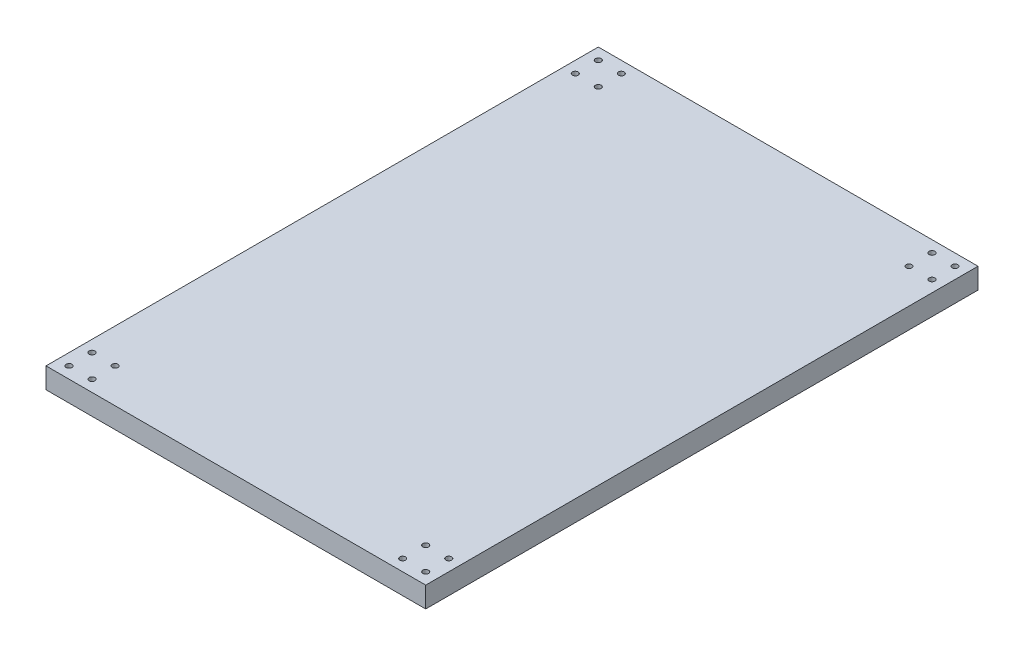
ISO-10303-21;
HEADER;
FILE_DESCRIPTION(('STEP AP214'),'2;1');
FILE_NAME('part.step','',(''),(''),'','','');
FILE_SCHEMA(('AUTOMOTIVE_DESIGN { 1 0 10303 214 1 1 1 1 }'));
ENDSEC;
DATA;
#1=APPLICATION_CONTEXT('core data for automotive mechanical design processes');
#2=APPLICATION_PROTOCOL_DEFINITION('international standard','automotive_design',2000,#1);
#3=PRODUCT_CONTEXT('',#1,'mechanical');
#4=PRODUCT('Part','Part','',(#3));
#5=PRODUCT_RELATED_PRODUCT_CATEGORY('part','',(#4));
#6=PRODUCT_DEFINITION_FORMATION('','',#4);
#7=PRODUCT_DEFINITION_CONTEXT('part definition',#1,'design');
#8=PRODUCT_DEFINITION('design','',#6,#7);
#9=PRODUCT_DEFINITION_SHAPE('','',#8);
#10=(LENGTH_UNIT() NAMED_UNIT(*) SI_UNIT(.MILLI.,.METRE.));
#11=(NAMED_UNIT(*) PLANE_ANGLE_UNIT() SI_UNIT($,.RADIAN.));
#12=(NAMED_UNIT(*) SI_UNIT($,.STERADIAN.) SOLID_ANGLE_UNIT());
#13=UNCERTAINTY_MEASURE_WITH_UNIT(LENGTH_MEASURE(1.E-05),#10,'distance_accuracy_value','');
#14=(GEOMETRIC_REPRESENTATION_CONTEXT(3) GLOBAL_UNCERTAINTY_ASSIGNED_CONTEXT((#13)) GLOBAL_UNIT_ASSIGNED_CONTEXT((#10,
#11,#12)) REPRESENTATION_CONTEXT('',''));
#15=CARTESIAN_POINT('',(0.,0.,0.));
#16=DIRECTION('',(0.,0.,1.));
#17=DIRECTION('',(1.,0.,0.));
#18=AXIS2_PLACEMENT_3D('',#15,#16,#17);
#19=CARTESIAN_POINT('',(0.,18.,0.));
#20=DIRECTION('',(0.,-1.,0.));
#21=DIRECTION('',(0.,0.,-1.));
#22=AXIS2_PLACEMENT_3D('',#19,#20,#21);
#23=PLANE('',#22);
#24=DIRECTION('',(0.,0.,1.));
#25=VECTOR('',#24,1.);
#26=CARTESIAN_POINT('',(0.,18.,0.));
#27=LINE('',#26,#25);
#28=CARTESIAN_POINT('',(0.,18.,-480.));
#29=VERTEX_POINT('',#28);
#30=CARTESIAN_POINT('',(0.,18.,0.));
#31=VERTEX_POINT('',#30);
#32=EDGE_CURVE('E93',#29,#31,#27,.T.);
#33=ORIENTED_EDGE('',*,*,#32,.T.);
#34=DIRECTION('',(1.,0.,0.));
#35=VECTOR('',#34,1.);
#36=CARTESIAN_POINT('',(0.,18.,0.));
#37=LINE('',#36,#35);
#38=CARTESIAN_POINT('',(330.,18.,0.));
#39=VERTEX_POINT('',#38);
#40=EDGE_CURVE('E88',#31,#39,#37,.T.);
#41=ORIENTED_EDGE('',*,*,#40,.T.);
#42=DIRECTION('',(0.,0.,-1.));
#43=VECTOR('',#42,1.);
#44=CARTESIAN_POINT('',(330.,18.,0.));
#45=LINE('',#44,#43);
#46=CARTESIAN_POINT('',(330.,18.,-480.));
#47=VERTEX_POINT('',#46);
#48=EDGE_CURVE('E91',#39,#47,#45,.T.);
#49=ORIENTED_EDGE('',*,*,#48,.T.);
#50=DIRECTION('',(-1.,0.,0.));
#51=VECTOR('',#50,1.);
#52=CARTESIAN_POINT('',(0.,18.,-480.));
#53=LINE('',#52,#51);
#54=EDGE_CURVE('E58',#47,#29,#53,.T.);
#55=ORIENTED_EDGE('',*,*,#54,.T.);
#56=EDGE_LOOP('',(#33,#41,#49,#55));
#57=FACE_BOUND('',#56,.T.);
#58=CARTESIAN_POINT('',(10.,18.,-10.));
#59=DIRECTION('',(0.,1.,0.));
#60=DIRECTION('',(0.,0.,1.));
#61=AXIS2_PLACEMENT_3D('',#58,#59,#60);
#62=CIRCLE('',#61,2.5);
#63=CARTESIAN_POINT('',(10.,18.,-7.5));
#64=VERTEX_POINT('',#63);
#65=EDGE_CURVE('E108',#64,#64,#62,.T.);
#66=ORIENTED_EDGE('',*,*,#65,.F.);
#67=EDGE_LOOP('',(#66));
#68=FACE_BOUND('',#67,.T.);
#69=CARTESIAN_POINT('',(30.,18.,-9.99999999999999));
#70=DIRECTION('',(0.,1.,0.));
#71=DIRECTION('',(0.,0.,1.));
#72=AXIS2_PLACEMENT_3D('',#69,#70,#71);
#73=CIRCLE('',#72,2.49999999999999);
#74=CARTESIAN_POINT('',(30.,18.,-7.5));
#75=VERTEX_POINT('',#74);
#76=EDGE_CURVE('E123',#75,#75,#73,.T.);
#77=ORIENTED_EDGE('',*,*,#76,.F.);
#78=EDGE_LOOP('',(#77));
#79=FACE_BOUND('',#78,.T.);
#80=CARTESIAN_POINT('',(10.,18.,-30.));
#81=DIRECTION('',(0.,1.,0.));
#82=DIRECTION('',(0.,0.,1.));
#83=AXIS2_PLACEMENT_3D('',#80,#81,#82);
#84=CIRCLE('',#83,2.5);
#85=CARTESIAN_POINT('',(10.,18.,-27.5));
#86=VERTEX_POINT('',#85);
#87=EDGE_CURVE('E129',#86,#86,#84,.T.);
#88=ORIENTED_EDGE('',*,*,#87,.F.);
#89=EDGE_LOOP('',(#88));
#90=FACE_BOUND('',#89,.T.);
#91=CARTESIAN_POINT('',(30.,18.,-30.));
#92=DIRECTION('',(0.,1.,0.));
#93=DIRECTION('',(0.,0.,1.));
#94=AXIS2_PLACEMENT_3D('',#91,#92,#93);
#95=CIRCLE('',#94,2.49999999999999);
#96=CARTESIAN_POINT('',(30.,18.,-27.5));
#97=VERTEX_POINT('',#96);
#98=EDGE_CURVE('E135',#97,#97,#95,.T.);
#99=ORIENTED_EDGE('',*,*,#98,.F.);
#100=EDGE_LOOP('',(#99));
#101=FACE_BOUND('',#100,.T.);
#102=CARTESIAN_POINT('',(320.,18.,-30.));
#103=DIRECTION('',(0.,1.,0.));
#104=DIRECTION('',(0.,0.,-1.));
#105=AXIS2_PLACEMENT_3D('',#102,#103,#104);
#106=CIRCLE('',#105,2.50000000000002);
#107=CARTESIAN_POINT('',(320.,18.,-32.5));
#108=VERTEX_POINT('',#107);
#109=EDGE_CURVE('E141',#108,#108,#106,.T.);
#110=ORIENTED_EDGE('',*,*,#109,.F.);
#111=EDGE_LOOP('',(#110));
#112=FACE_BOUND('',#111,.T.);
#113=CARTESIAN_POINT('',(320.,18.,-10.));
#114=DIRECTION('',(0.,1.,0.));
#115=DIRECTION('',(0.,0.,-1.));
#116=AXIS2_PLACEMENT_3D('',#113,#114,#115);
#117=CIRCLE('',#116,2.50000000000002);
#118=CARTESIAN_POINT('',(320.,18.,-12.5));
#119=VERTEX_POINT('',#118);
#120=EDGE_CURVE('E147',#119,#119,#117,.T.);
#121=ORIENTED_EDGE('',*,*,#120,.F.);
#122=EDGE_LOOP('',(#121));
#123=FACE_BOUND('',#122,.T.);
#124=CARTESIAN_POINT('',(300.,18.,-9.99999999999999));
#125=DIRECTION('',(0.,1.,0.));
#126=DIRECTION('',(0.,0.,-1.));
#127=AXIS2_PLACEMENT_3D('',#124,#125,#126);
#128=CIRCLE('',#127,2.50000000000002);
#129=CARTESIAN_POINT('',(300.,18.,-12.5));
#130=VERTEX_POINT('',#129);
#131=EDGE_CURVE('E153',#130,#130,#128,.T.);
#132=ORIENTED_EDGE('',*,*,#131,.F.);
#133=EDGE_LOOP('',(#132));
#134=FACE_BOUND('',#133,.T.);
#135=CARTESIAN_POINT('',(300.,18.,-30.));
#136=DIRECTION('',(0.,1.,0.));
#137=DIRECTION('',(0.,0.,-1.));
#138=AXIS2_PLACEMENT_3D('',#135,#136,#137);
#139=CIRCLE('',#138,2.50000000000002);
#140=CARTESIAN_POINT('',(300.,18.,-32.5));
#141=VERTEX_POINT('',#140);
#142=EDGE_CURVE('E159',#141,#141,#139,.T.);
#143=ORIENTED_EDGE('',*,*,#142,.F.);
#144=EDGE_LOOP('',(#143));
#145=FACE_BOUND('',#144,.T.);
#146=CARTESIAN_POINT('',(300.,18.,-470.));
#147=DIRECTION('',(0.,1.,0.));
#148=DIRECTION('',(0.,0.,1.));
#149=AXIS2_PLACEMENT_3D('',#146,#147,#148);
#150=CIRCLE('',#149,2.50000000000001);
#151=CARTESIAN_POINT('',(300.,18.,-467.5));
#152=VERTEX_POINT('',#151);
#153=EDGE_CURVE('E165',#152,#152,#150,.T.);
#154=ORIENTED_EDGE('',*,*,#153,.F.);
#155=EDGE_LOOP('',(#154));
#156=FACE_BOUND('',#155,.T.);
#157=CARTESIAN_POINT('',(320.,18.,-470.));
#158=DIRECTION('',(0.,1.,0.));
#159=DIRECTION('',(0.,0.,1.));
#160=AXIS2_PLACEMENT_3D('',#157,#158,#159);
#161=CIRCLE('',#160,2.50000000000002);
#162=CARTESIAN_POINT('',(320.,18.,-467.5));
#163=VERTEX_POINT('',#162);
#164=EDGE_CURVE('E171',#163,#163,#161,.T.);
#165=ORIENTED_EDGE('',*,*,#164,.F.);
#166=EDGE_LOOP('',(#165));
#167=FACE_BOUND('',#166,.T.);
#168=CARTESIAN_POINT('',(320.,18.,-450.));
#169=DIRECTION('',(0.,1.,0.));
#170=DIRECTION('',(0.,0.,1.));
#171=AXIS2_PLACEMENT_3D('',#168,#169,#170);
#172=CIRCLE('',#171,2.50000000000002);
#173=CARTESIAN_POINT('',(320.,18.,-447.5));
#174=VERTEX_POINT('',#173);
#175=EDGE_CURVE('E177',#174,#174,#172,.T.);
#176=ORIENTED_EDGE('',*,*,#175,.F.);
#177=EDGE_LOOP('',(#176));
#178=FACE_BOUND('',#177,.T.);
#179=CARTESIAN_POINT('',(300.,18.,-450.));
#180=DIRECTION('',(0.,1.,0.));
#181=DIRECTION('',(0.,0.,1.));
#182=AXIS2_PLACEMENT_3D('',#179,#180,#181);
#183=CIRCLE('',#182,2.50000000000002);
#184=CARTESIAN_POINT('',(300.,18.,-447.5));
#185=VERTEX_POINT('',#184);
#186=EDGE_CURVE('E183',#185,#185,#183,.T.);
#187=ORIENTED_EDGE('',*,*,#186,.F.);
#188=EDGE_LOOP('',(#187));
#189=FACE_BOUND('',#188,.T.);
#190=CARTESIAN_POINT('',(30.,18.,-470.));
#191=DIRECTION('',(0.,1.,0.));
#192=DIRECTION('',(0.,0.,-1.));
#193=AXIS2_PLACEMENT_3D('',#190,#191,#192);
#194=CIRCLE('',#193,2.49999999999998);
#195=CARTESIAN_POINT('',(30.,18.,-472.5));
#196=VERTEX_POINT('',#195);
#197=EDGE_CURVE('E189',#196,#196,#194,.T.);
#198=ORIENTED_EDGE('',*,*,#197,.F.);
#199=EDGE_LOOP('',(#198));
#200=FACE_BOUND('',#199,.T.);
#201=CARTESIAN_POINT('',(10.,18.,-470.));
#202=DIRECTION('',(0.,1.,0.));
#203=DIRECTION('',(0.,0.,-1.));
#204=AXIS2_PLACEMENT_3D('',#201,#202,#203);
#205=CIRCLE('',#204,2.5);
#206=CARTESIAN_POINT('',(10.,18.,-472.5));
#207=VERTEX_POINT('',#206);
#208=EDGE_CURVE('E195',#207,#207,#205,.T.);
#209=ORIENTED_EDGE('',*,*,#208,.F.);
#210=EDGE_LOOP('',(#209));
#211=FACE_BOUND('',#210,.T.);
#212=CARTESIAN_POINT('',(10.,18.,-450.));
#213=DIRECTION('',(0.,1.,0.));
#214=DIRECTION('',(0.,0.,-1.));
#215=AXIS2_PLACEMENT_3D('',#212,#213,#214);
#216=CIRCLE('',#215,2.5);
#217=CARTESIAN_POINT('',(10.,18.,-452.5));
#218=VERTEX_POINT('',#217);
#219=EDGE_CURVE('E201',#218,#218,#216,.T.);
#220=ORIENTED_EDGE('',*,*,#219,.F.);
#221=EDGE_LOOP('',(#220));
#222=FACE_BOUND('',#221,.T.);
#223=CARTESIAN_POINT('',(30.,18.,-450.));
#224=DIRECTION('',(0.,1.,0.));
#225=DIRECTION('',(0.,0.,-1.));
#226=AXIS2_PLACEMENT_3D('',#223,#224,#225);
#227=CIRCLE('',#226,2.5);
#228=CARTESIAN_POINT('',(30.,18.,-452.5));
#229=VERTEX_POINT('',#228);
#230=EDGE_CURVE('E207',#229,#229,#227,.T.);
#231=ORIENTED_EDGE('',*,*,#230,.F.);
#232=EDGE_LOOP('',(#231));
#233=FACE_BOUND('',#232,.T.);
#234=ADVANCED_FACE('F41',(#57,#68,#79,#90,#101,#112,#123,#134,#145,#156,#167,#178,#189,#200,
#211,#222,#233),#23,.F.);
#235=CARTESIAN_POINT('',(0.,0.,0.));
#236=DIRECTION('',(0.,-1.,0.));
#237=DIRECTION('',(0.,0.,-1.));
#238=AXIS2_PLACEMENT_3D('',#235,#236,#237);
#239=PLANE('',#238);
#240=CARTESIAN_POINT('',(10.,0.,-450.));
#241=DIRECTION('',(0.,1.,0.));
#242=DIRECTION('',(0.,0.,-1.));
#243=AXIS2_PLACEMENT_3D('',#240,#241,#242);
#244=CIRCLE('',#243,2.5);
#245=CARTESIAN_POINT('',(10.,0.,-452.5));
#246=VERTEX_POINT('',#245);
#247=EDGE_CURVE('E204',#246,#246,#244,.T.);
#248=ORIENTED_EDGE('',*,*,#247,.T.);
#249=EDGE_LOOP('',(#248));
#250=FACE_BOUND('',#249,.T.);
#251=CARTESIAN_POINT('',(30.,0.,-470.));
#252=DIRECTION('',(0.,1.,0.));
#253=DIRECTION('',(0.,0.,-1.));
#254=AXIS2_PLACEMENT_3D('',#251,#252,#253);
#255=CIRCLE('',#254,2.49999999999998);
#256=CARTESIAN_POINT('',(30.,0.,-472.5));
#257=VERTEX_POINT('',#256);
#258=EDGE_CURVE('E192',#257,#257,#255,.T.);
#259=ORIENTED_EDGE('',*,*,#258,.T.);
#260=EDGE_LOOP('',(#259));
#261=FACE_BOUND('',#260,.T.);
#262=CARTESIAN_POINT('',(320.,0.,-450.));
#263=DIRECTION('',(0.,1.,0.));
#264=DIRECTION('',(0.,0.,1.));
#265=AXIS2_PLACEMENT_3D('',#262,#263,#264);
#266=CIRCLE('',#265,2.50000000000002);
#267=CARTESIAN_POINT('',(320.,0.,-447.5));
#268=VERTEX_POINT('',#267);
#269=EDGE_CURVE('E180',#268,#268,#266,.T.);
#270=ORIENTED_EDGE('',*,*,#269,.T.);
#271=EDGE_LOOP('',(#270));
#272=FACE_BOUND('',#271,.T.);
#273=CARTESIAN_POINT('',(300.,0.,-470.));
#274=DIRECTION('',(0.,1.,0.));
#275=DIRECTION('',(0.,0.,1.));
#276=AXIS2_PLACEMENT_3D('',#273,#274,#275);
#277=CIRCLE('',#276,2.50000000000001);
#278=CARTESIAN_POINT('',(300.,0.,-467.5));
#279=VERTEX_POINT('',#278);
#280=EDGE_CURVE('E168',#279,#279,#277,.T.);
#281=ORIENTED_EDGE('',*,*,#280,.T.);
#282=EDGE_LOOP('',(#281));
#283=FACE_BOUND('',#282,.T.);
#284=CARTESIAN_POINT('',(300.,0.,-9.99999999999999));
#285=DIRECTION('',(0.,1.,0.));
#286=DIRECTION('',(0.,0.,-1.));
#287=AXIS2_PLACEMENT_3D('',#284,#285,#286);
#288=CIRCLE('',#287,2.50000000000002);
#289=CARTESIAN_POINT('',(300.,0.,-12.5));
#290=VERTEX_POINT('',#289);
#291=EDGE_CURVE('E156',#290,#290,#288,.T.);
#292=ORIENTED_EDGE('',*,*,#291,.T.);
#293=EDGE_LOOP('',(#292));
#294=FACE_BOUND('',#293,.T.);
#295=CARTESIAN_POINT('',(320.,0.,-30.));
#296=DIRECTION('',(0.,1.,0.));
#297=DIRECTION('',(0.,0.,-1.));
#298=AXIS2_PLACEMENT_3D('',#295,#296,#297);
#299=CIRCLE('',#298,2.50000000000002);
#300=CARTESIAN_POINT('',(320.,0.,-32.5));
#301=VERTEX_POINT('',#300);
#302=EDGE_CURVE('E144',#301,#301,#299,.T.);
#303=ORIENTED_EDGE('',*,*,#302,.T.);
#304=EDGE_LOOP('',(#303));
#305=FACE_BOUND('',#304,.T.);
#306=CARTESIAN_POINT('',(10.,0.,-30.));
#307=DIRECTION('',(0.,1.,0.));
#308=DIRECTION('',(0.,0.,1.));
#309=AXIS2_PLACEMENT_3D('',#306,#307,#308);
#310=CIRCLE('',#309,2.5);
#311=CARTESIAN_POINT('',(10.,0.,-27.5));
#312=VERTEX_POINT('',#311);
#313=EDGE_CURVE('E132',#312,#312,#310,.T.);
#314=ORIENTED_EDGE('',*,*,#313,.T.);
#315=EDGE_LOOP('',(#314));
#316=FACE_BOUND('',#315,.T.);
#317=CARTESIAN_POINT('',(10.,0.,-10.));
#318=DIRECTION('',(0.,1.,0.));
#319=DIRECTION('',(0.,0.,1.));
#320=AXIS2_PLACEMENT_3D('',#317,#318,#319);
#321=CIRCLE('',#320,2.5);
#322=CARTESIAN_POINT('',(10.,0.,-7.5));
#323=VERTEX_POINT('',#322);
#324=EDGE_CURVE('E120',#323,#323,#321,.T.);
#325=ORIENTED_EDGE('',*,*,#324,.T.);
#326=EDGE_LOOP('',(#325));
#327=FACE_BOUND('',#326,.T.);
#328=DIRECTION('',(0.,0.,1.));
#329=VECTOR('',#328,1.);
#330=CARTESIAN_POINT('',(0.,0.,0.));
#331=LINE('',#330,#329);
#332=CARTESIAN_POINT('',(0.,0.,-480.));
#333=VERTEX_POINT('',#332);
#334=CARTESIAN_POINT('',(0.,0.,0.));
#335=VERTEX_POINT('',#334);
#336=EDGE_CURVE('E105',#333,#335,#331,.T.);
#337=ORIENTED_EDGE('',*,*,#336,.F.);
#338=DIRECTION('',(-1.,0.,0.));
#339=VECTOR('',#338,1.);
#340=CARTESIAN_POINT('',(0.,0.,-480.));
#341=LINE('',#340,#339);
#342=CARTESIAN_POINT('',(330.,0.,-480.));
#343=VERTEX_POINT('',#342);
#344=EDGE_CURVE('E81',#343,#333,#341,.T.);
#345=ORIENTED_EDGE('',*,*,#344,.F.);
#346=DIRECTION('',(0.,0.,-1.));
#347=VECTOR('',#346,1.);
#348=CARTESIAN_POINT('',(330.,0.,0.));
#349=LINE('',#348,#347);
#350=CARTESIAN_POINT('',(330.,0.,0.));
#351=VERTEX_POINT('',#350);
#352=EDGE_CURVE('E75',#351,#343,#349,.T.);
#353=ORIENTED_EDGE('',*,*,#352,.F.);
#354=DIRECTION('',(1.,0.,0.));
#355=VECTOR('',#354,1.);
#356=CARTESIAN_POINT('',(0.,0.,0.));
#357=LINE('',#356,#355);
#358=EDGE_CURVE('E97',#335,#351,#357,.T.);
#359=ORIENTED_EDGE('',*,*,#358,.F.);
#360=EDGE_LOOP('',(#337,#345,#353,#359));
#361=FACE_BOUND('',#360,.T.);
#362=CARTESIAN_POINT('',(30.,0.,-9.99999999999999));
#363=DIRECTION('',(0.,1.,0.));
#364=DIRECTION('',(0.,0.,1.));
#365=AXIS2_PLACEMENT_3D('',#362,#363,#364);
#366=CIRCLE('',#365,2.49999999999999);
#367=CARTESIAN_POINT('',(30.,0.,-7.5));
#368=VERTEX_POINT('',#367);
#369=EDGE_CURVE('E126',#368,#368,#366,.T.);
#370=ORIENTED_EDGE('',*,*,#369,.T.);
#371=EDGE_LOOP('',(#370));
#372=FACE_BOUND('',#371,.T.);
#373=CARTESIAN_POINT('',(30.,0.,-30.));
#374=DIRECTION('',(0.,1.,0.));
#375=DIRECTION('',(0.,0.,1.));
#376=AXIS2_PLACEMENT_3D('',#373,#374,#375);
#377=CIRCLE('',#376,2.49999999999999);
#378=CARTESIAN_POINT('',(30.,0.,-27.5));
#379=VERTEX_POINT('',#378);
#380=EDGE_CURVE('E138',#379,#379,#377,.T.);
#381=ORIENTED_EDGE('',*,*,#380,.T.);
#382=EDGE_LOOP('',(#381));
#383=FACE_BOUND('',#382,.T.);
#384=CARTESIAN_POINT('',(320.,0.,-10.));
#385=DIRECTION('',(0.,1.,0.));
#386=DIRECTION('',(0.,0.,-1.));
#387=AXIS2_PLACEMENT_3D('',#384,#385,#386);
#388=CIRCLE('',#387,2.50000000000002);
#389=CARTESIAN_POINT('',(320.,0.,-12.5));
#390=VERTEX_POINT('',#389);
#391=EDGE_CURVE('E150',#390,#390,#388,.T.);
#392=ORIENTED_EDGE('',*,*,#391,.T.);
#393=EDGE_LOOP('',(#392));
#394=FACE_BOUND('',#393,.T.);
#395=CARTESIAN_POINT('',(300.,0.,-30.));
#396=DIRECTION('',(0.,1.,0.));
#397=DIRECTION('',(0.,0.,-1.));
#398=AXIS2_PLACEMENT_3D('',#395,#396,#397);
#399=CIRCLE('',#398,2.50000000000002);
#400=CARTESIAN_POINT('',(300.,0.,-32.5));
#401=VERTEX_POINT('',#400);
#402=EDGE_CURVE('E162',#401,#401,#399,.T.);
#403=ORIENTED_EDGE('',*,*,#402,.T.);
#404=EDGE_LOOP('',(#403));
#405=FACE_BOUND('',#404,.T.);
#406=CARTESIAN_POINT('',(320.,0.,-470.));
#407=DIRECTION('',(0.,1.,0.));
#408=DIRECTION('',(0.,0.,1.));
#409=AXIS2_PLACEMENT_3D('',#406,#407,#408);
#410=CIRCLE('',#409,2.50000000000002);
#411=CARTESIAN_POINT('',(320.,0.,-467.5));
#412=VERTEX_POINT('',#411);
#413=EDGE_CURVE('E174',#412,#412,#410,.T.);
#414=ORIENTED_EDGE('',*,*,#413,.T.);
#415=EDGE_LOOP('',(#414));
#416=FACE_BOUND('',#415,.T.);
#417=CARTESIAN_POINT('',(300.,0.,-450.));
#418=DIRECTION('',(0.,1.,0.));
#419=DIRECTION('',(0.,0.,1.));
#420=AXIS2_PLACEMENT_3D('',#417,#418,#419);
#421=CIRCLE('',#420,2.50000000000002);
#422=CARTESIAN_POINT('',(300.,0.,-447.5));
#423=VERTEX_POINT('',#422);
#424=EDGE_CURVE('E186',#423,#423,#421,.T.);
#425=ORIENTED_EDGE('',*,*,#424,.T.);
#426=EDGE_LOOP('',(#425));
#427=FACE_BOUND('',#426,.T.);
#428=CARTESIAN_POINT('',(10.,0.,-470.));
#429=DIRECTION('',(0.,1.,0.));
#430=DIRECTION('',(0.,0.,-1.));
#431=AXIS2_PLACEMENT_3D('',#428,#429,#430);
#432=CIRCLE('',#431,2.5);
#433=CARTESIAN_POINT('',(10.,0.,-472.5));
#434=VERTEX_POINT('',#433);
#435=EDGE_CURVE('E198',#434,#434,#432,.T.);
#436=ORIENTED_EDGE('',*,*,#435,.T.);
#437=EDGE_LOOP('',(#436));
#438=FACE_BOUND('',#437,.T.);
#439=CARTESIAN_POINT('',(30.,0.,-450.));
#440=DIRECTION('',(0.,1.,0.));
#441=DIRECTION('',(0.,0.,-1.));
#442=AXIS2_PLACEMENT_3D('',#439,#440,#441);
#443=CIRCLE('',#442,2.5);
#444=CARTESIAN_POINT('',(30.,0.,-452.5));
#445=VERTEX_POINT('',#444);
#446=EDGE_CURVE('E210',#445,#445,#443,.T.);
#447=ORIENTED_EDGE('',*,*,#446,.T.);
#448=EDGE_LOOP('',(#447));
#449=FACE_BOUND('',#448,.T.);
#450=ADVANCED_FACE('F116',(#250,#261,#272,#283,#294,#305,#316,#327,#361,#372,#383,#394,#405,
#416,#427,#438,#449),#239,.T.);
#451=CARTESIAN_POINT('',(0.,18.,0.));
#452=DIRECTION('',(1.,0.,0.));
#453=DIRECTION('',(0.,0.,-1.));
#454=AXIS2_PLACEMENT_3D('',#451,#452,#453);
#455=PLANE('',#454);
#456=ORIENTED_EDGE('',*,*,#336,.T.);
#457=DIRECTION('',(0.,-1.,0.));
#458=VECTOR('',#457,1.);
#459=CARTESIAN_POINT('',(0.,18.,0.));
#460=LINE('',#459,#458);
#461=EDGE_CURVE('E11',#31,#335,#460,.T.);
#462=ORIENTED_EDGE('',*,*,#461,.F.);
#463=ORIENTED_EDGE('',*,*,#32,.F.);
#464=DIRECTION('',(0.,-1.,0.));
#465=VECTOR('',#464,1.);
#466=CARTESIAN_POINT('',(0.,18.,-480.));
#467=LINE('',#466,#465);
#468=EDGE_CURVE('E101',#29,#333,#467,.T.);
#469=ORIENTED_EDGE('',*,*,#468,.T.);
#470=EDGE_LOOP('',(#456,#462,#463,#469));
#471=FACE_BOUND('',#470,.T.);
#472=ADVANCED_FACE('F43',(#471),#455,.F.);
#473=CARTESIAN_POINT('',(0.,18.,0.));
#474=DIRECTION('',(0.,0.,-1.));
#475=DIRECTION('',(-1.,0.,0.));
#476=AXIS2_PLACEMENT_3D('',#473,#474,#475);
#477=PLANE('',#476);
#478=ORIENTED_EDGE('',*,*,#358,.T.);
#479=DIRECTION('',(0.,-1.,0.));
#480=VECTOR('',#479,1.);
#481=CARTESIAN_POINT('',(330.,18.,0.));
#482=LINE('',#481,#480);
#483=EDGE_CURVE('E50',#39,#351,#482,.T.);
#484=ORIENTED_EDGE('',*,*,#483,.F.);
#485=ORIENTED_EDGE('',*,*,#40,.F.);
#486=ORIENTED_EDGE('',*,*,#461,.T.);
#487=EDGE_LOOP('',(#478,#484,#485,#486));
#488=FACE_BOUND('',#487,.T.);
#489=ADVANCED_FACE('F96',(#488),#477,.F.);
#490=CARTESIAN_POINT('',(330.,18.,0.));
#491=DIRECTION('',(-1.,0.,0.));
#492=DIRECTION('',(0.,0.,1.));
#493=AXIS2_PLACEMENT_3D('',#490,#491,#492);
#494=PLANE('',#493);
#495=ORIENTED_EDGE('',*,*,#352,.T.);
#496=DIRECTION('',(0.,-1.,0.));
#497=VECTOR('',#496,1.);
#498=CARTESIAN_POINT('',(330.,18.,-480.));
#499=LINE('',#498,#497);
#500=EDGE_CURVE('E98',#47,#343,#499,.T.);
#501=ORIENTED_EDGE('',*,*,#500,.F.);
#502=ORIENTED_EDGE('',*,*,#48,.F.);
#503=ORIENTED_EDGE('',*,*,#483,.T.);
#504=EDGE_LOOP('',(#495,#501,#502,#503));
#505=FACE_BOUND('',#504,.T.);
#506=ADVANCED_FACE('F99',(#505),#494,.F.);
#507=CARTESIAN_POINT('',(0.,18.,-480.));
#508=DIRECTION('',(0.,0.,1.));
#509=DIRECTION('',(1.,0.,0.));
#510=AXIS2_PLACEMENT_3D('',#507,#508,#509);
#511=PLANE('',#510);
#512=ORIENTED_EDGE('',*,*,#344,.T.);
#513=ORIENTED_EDGE('',*,*,#468,.F.);
#514=ORIENTED_EDGE('',*,*,#54,.F.);
#515=ORIENTED_EDGE('',*,*,#500,.T.);
#516=EDGE_LOOP('',(#512,#513,#514,#515));
#517=FACE_BOUND('',#516,.T.);
#518=ADVANCED_FACE('F113',(#517),#511,.F.);
#519=CARTESIAN_POINT('',(10.,18.,-10.));
#520=DIRECTION('',(0.,-1.,0.));
#521=DIRECTION('',(0.,0.,-1.));
#522=AXIS2_PLACEMENT_3D('',#519,#520,#521);
#523=CYLINDRICAL_SURFACE('',#522,2.5);
#524=ORIENTED_EDGE('',*,*,#65,.T.);
#525=EDGE_LOOP('',(#524));
#526=FACE_BOUND('',#525,.T.);
#527=ORIENTED_EDGE('',*,*,#324,.F.);
#528=EDGE_LOOP('',(#527));
#529=FACE_BOUND('',#528,.T.);
#530=ADVANCED_FACE('F227',(#526,#529),#523,.F.);
#531=CARTESIAN_POINT('',(30.,18.,-9.99999999999999));
#532=DIRECTION('',(0.,-1.,0.));
#533=DIRECTION('',(0.,0.,-1.));
#534=AXIS2_PLACEMENT_3D('',#531,#532,#533);
#535=CYLINDRICAL_SURFACE('',#534,2.49999999999999);
#536=ORIENTED_EDGE('',*,*,#76,.T.);
#537=EDGE_LOOP('',(#536));
#538=FACE_BOUND('',#537,.T.);
#539=ORIENTED_EDGE('',*,*,#369,.F.);
#540=EDGE_LOOP('',(#539));
#541=FACE_BOUND('',#540,.T.);
#542=ADVANCED_FACE('F272',(#538,#541),#535,.F.);
#543=CARTESIAN_POINT('',(10.,18.,-30.));
#544=DIRECTION('',(0.,-1.,0.));
#545=DIRECTION('',(0.,0.,-1.));
#546=AXIS2_PLACEMENT_3D('',#543,#544,#545);
#547=CYLINDRICAL_SURFACE('',#546,2.5);
#548=ORIENTED_EDGE('',*,*,#87,.T.);
#549=EDGE_LOOP('',(#548));
#550=FACE_BOUND('',#549,.T.);
#551=ORIENTED_EDGE('',*,*,#313,.F.);
#552=EDGE_LOOP('',(#551));
#553=FACE_BOUND('',#552,.T.);
#554=ADVANCED_FACE('F280',(#550,#553),#547,.F.);
#555=CARTESIAN_POINT('',(30.,18.,-30.));
#556=DIRECTION('',(0.,-1.,0.));
#557=DIRECTION('',(0.,0.,-1.));
#558=AXIS2_PLACEMENT_3D('',#555,#556,#557);
#559=CYLINDRICAL_SURFACE('',#558,2.49999999999999);
#560=ORIENTED_EDGE('',*,*,#98,.T.);
#561=EDGE_LOOP('',(#560));
#562=FACE_BOUND('',#561,.T.);
#563=ORIENTED_EDGE('',*,*,#380,.F.);
#564=EDGE_LOOP('',(#563));
#565=FACE_BOUND('',#564,.T.);
#566=ADVANCED_FACE('F288',(#562,#565),#559,.F.);
#567=CARTESIAN_POINT('',(320.,18.,-30.));
#568=DIRECTION('',(0.,-1.,0.));
#569=DIRECTION('',(0.,0.,-1.));
#570=AXIS2_PLACEMENT_3D('',#567,#568,#569);
#571=CYLINDRICAL_SURFACE('',#570,2.50000000000002);
#572=ORIENTED_EDGE('',*,*,#109,.T.);
#573=EDGE_LOOP('',(#572));
#574=FACE_BOUND('',#573,.T.);
#575=ORIENTED_EDGE('',*,*,#302,.F.);
#576=EDGE_LOOP('',(#575));
#577=FACE_BOUND('',#576,.T.);
#578=ADVANCED_FACE('F297',(#574,#577),#571,.F.);
#579=CARTESIAN_POINT('',(320.,18.,-10.));
#580=DIRECTION('',(0.,-1.,0.));
#581=DIRECTION('',(0.,0.,-1.));
#582=AXIS2_PLACEMENT_3D('',#579,#580,#581);
#583=CYLINDRICAL_SURFACE('',#582,2.50000000000002);
#584=ORIENTED_EDGE('',*,*,#120,.T.);
#585=EDGE_LOOP('',(#584));
#586=FACE_BOUND('',#585,.T.);
#587=ORIENTED_EDGE('',*,*,#391,.F.);
#588=EDGE_LOOP('',(#587));
#589=FACE_BOUND('',#588,.T.);
#590=ADVANCED_FACE('F306',(#586,#589),#583,.F.);
#591=CARTESIAN_POINT('',(300.,18.,-9.99999999999999));
#592=DIRECTION('',(0.,-1.,0.));
#593=DIRECTION('',(0.,0.,-1.));
#594=AXIS2_PLACEMENT_3D('',#591,#592,#593);
#595=CYLINDRICAL_SURFACE('',#594,2.50000000000002);
#596=ORIENTED_EDGE('',*,*,#131,.T.);
#597=EDGE_LOOP('',(#596));
#598=FACE_BOUND('',#597,.T.);
#599=ORIENTED_EDGE('',*,*,#291,.F.);
#600=EDGE_LOOP('',(#599));
#601=FACE_BOUND('',#600,.T.);
#602=ADVANCED_FACE('F315',(#598,#601),#595,.F.);
#603=CARTESIAN_POINT('',(300.,18.,-30.));
#604=DIRECTION('',(0.,-1.,0.));
#605=DIRECTION('',(0.,0.,-1.));
#606=AXIS2_PLACEMENT_3D('',#603,#604,#605);
#607=CYLINDRICAL_SURFACE('',#606,2.50000000000002);
#608=ORIENTED_EDGE('',*,*,#142,.T.);
#609=EDGE_LOOP('',(#608));
#610=FACE_BOUND('',#609,.T.);
#611=ORIENTED_EDGE('',*,*,#402,.F.);
#612=EDGE_LOOP('',(#611));
#613=FACE_BOUND('',#612,.T.);
#614=ADVANCED_FACE('F324',(#610,#613),#607,.F.);
#615=CARTESIAN_POINT('',(300.,18.,-470.));
#616=DIRECTION('',(0.,-1.,0.));
#617=DIRECTION('',(0.,0.,-1.));
#618=AXIS2_PLACEMENT_3D('',#615,#616,#617);
#619=CYLINDRICAL_SURFACE('',#618,2.50000000000001);
#620=ORIENTED_EDGE('',*,*,#153,.T.);
#621=EDGE_LOOP('',(#620));
#622=FACE_BOUND('',#621,.T.);
#623=ORIENTED_EDGE('',*,*,#280,.F.);
#624=EDGE_LOOP('',(#623));
#625=FACE_BOUND('',#624,.T.);
#626=ADVANCED_FACE('F333',(#622,#625),#619,.F.);
#627=CARTESIAN_POINT('',(320.,18.,-470.));
#628=DIRECTION('',(0.,-1.,0.));
#629=DIRECTION('',(0.,0.,-1.));
#630=AXIS2_PLACEMENT_3D('',#627,#628,#629);
#631=CYLINDRICAL_SURFACE('',#630,2.50000000000002);
#632=ORIENTED_EDGE('',*,*,#164,.T.);
#633=EDGE_LOOP('',(#632));
#634=FACE_BOUND('',#633,.T.);
#635=ORIENTED_EDGE('',*,*,#413,.F.);
#636=EDGE_LOOP('',(#635));
#637=FACE_BOUND('',#636,.T.);
#638=ADVANCED_FACE('F342',(#634,#637),#631,.F.);
#639=CARTESIAN_POINT('',(320.,18.,-450.));
#640=DIRECTION('',(0.,-1.,0.));
#641=DIRECTION('',(0.,0.,-1.));
#642=AXIS2_PLACEMENT_3D('',#639,#640,#641);
#643=CYLINDRICAL_SURFACE('',#642,2.50000000000002);
#644=ORIENTED_EDGE('',*,*,#175,.T.);
#645=EDGE_LOOP('',(#644));
#646=FACE_BOUND('',#645,.T.);
#647=ORIENTED_EDGE('',*,*,#269,.F.);
#648=EDGE_LOOP('',(#647));
#649=FACE_BOUND('',#648,.T.);
#650=ADVANCED_FACE('F351',(#646,#649),#643,.F.);
#651=CARTESIAN_POINT('',(300.,18.,-450.));
#652=DIRECTION('',(0.,-1.,0.));
#653=DIRECTION('',(0.,0.,-1.));
#654=AXIS2_PLACEMENT_3D('',#651,#652,#653);
#655=CYLINDRICAL_SURFACE('',#654,2.50000000000002);
#656=ORIENTED_EDGE('',*,*,#186,.T.);
#657=EDGE_LOOP('',(#656));
#658=FACE_BOUND('',#657,.T.);
#659=ORIENTED_EDGE('',*,*,#424,.F.);
#660=EDGE_LOOP('',(#659));
#661=FACE_BOUND('',#660,.T.);
#662=ADVANCED_FACE('F360',(#658,#661),#655,.F.);
#663=CARTESIAN_POINT('',(30.,18.,-470.));
#664=DIRECTION('',(0.,-1.,0.));
#665=DIRECTION('',(0.,0.,-1.));
#666=AXIS2_PLACEMENT_3D('',#663,#664,#665);
#667=CYLINDRICAL_SURFACE('',#666,2.49999999999998);
#668=ORIENTED_EDGE('',*,*,#197,.T.);
#669=EDGE_LOOP('',(#668));
#670=FACE_BOUND('',#669,.T.);
#671=ORIENTED_EDGE('',*,*,#258,.F.);
#672=EDGE_LOOP('',(#671));
#673=FACE_BOUND('',#672,.T.);
#674=ADVANCED_FACE('F369',(#670,#673),#667,.F.);
#675=CARTESIAN_POINT('',(10.,18.,-470.));
#676=DIRECTION('',(0.,-1.,0.));
#677=DIRECTION('',(0.,0.,-1.));
#678=AXIS2_PLACEMENT_3D('',#675,#676,#677);
#679=CYLINDRICAL_SURFACE('',#678,2.5);
#680=ORIENTED_EDGE('',*,*,#208,.T.);
#681=EDGE_LOOP('',(#680));
#682=FACE_BOUND('',#681,.T.);
#683=ORIENTED_EDGE('',*,*,#435,.F.);
#684=EDGE_LOOP('',(#683));
#685=FACE_BOUND('',#684,.T.);
#686=ADVANCED_FACE('F378',(#682,#685),#679,.F.);
#687=CARTESIAN_POINT('',(10.,18.,-450.));
#688=DIRECTION('',(0.,-1.,0.));
#689=DIRECTION('',(0.,0.,-1.));
#690=AXIS2_PLACEMENT_3D('',#687,#688,#689);
#691=CYLINDRICAL_SURFACE('',#690,2.5);
#692=ORIENTED_EDGE('',*,*,#219,.T.);
#693=EDGE_LOOP('',(#692));
#694=FACE_BOUND('',#693,.T.);
#695=ORIENTED_EDGE('',*,*,#247,.F.);
#696=EDGE_LOOP('',(#695));
#697=FACE_BOUND('',#696,.T.);
#698=ADVANCED_FACE('F387',(#694,#697),#691,.F.);
#699=CARTESIAN_POINT('',(30.,18.,-450.));
#700=DIRECTION('',(0.,-1.,0.));
#701=DIRECTION('',(0.,0.,-1.));
#702=AXIS2_PLACEMENT_3D('',#699,#700,#701);
#703=CYLINDRICAL_SURFACE('',#702,2.5);
#704=ORIENTED_EDGE('',*,*,#230,.T.);
#705=EDGE_LOOP('',(#704));
#706=FACE_BOUND('',#705,.T.);
#707=ORIENTED_EDGE('',*,*,#446,.F.);
#708=EDGE_LOOP('',(#707));
#709=FACE_BOUND('',#708,.T.);
#710=ADVANCED_FACE('F216',(#706,#709),#703,.F.);
#711=CLOSED_SHELL('',(#234,#450,#472,#489,#506,#518,#530,#542,#554,#566,#578,#590,#602,#614,
#626,#638,#650,#662,#674,#686,#698,#710));
#712=MANIFOLD_SOLID_BREP('B2',#711);
#713=ADVANCED_BREP_SHAPE_REPRESENTATION('',(#18,#712),#14);
#714=SHAPE_DEFINITION_REPRESENTATION(#9,#713);
ENDSEC;
END-ISO-10303-21;
